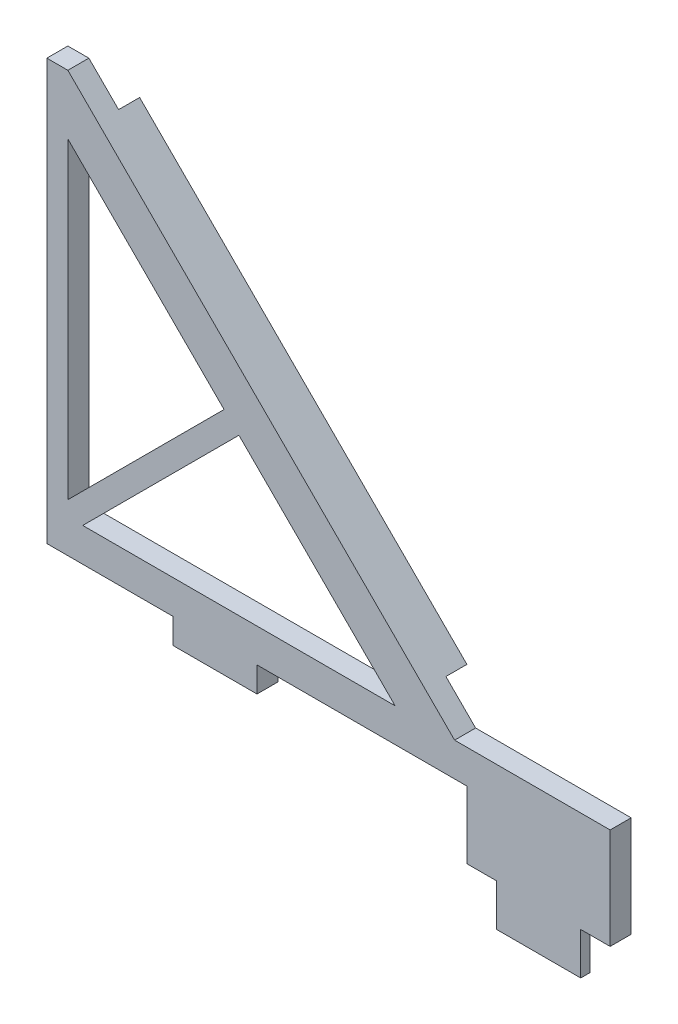
ISO-10303-21;
HEADER;
FILE_DESCRIPTION(('STEP AP214'),'2;1');
FILE_NAME('part.step','',(''),(''),'','','');
FILE_SCHEMA(('AUTOMOTIVE_DESIGN { 1 0 10303 214 1 1 1 1 }'));
ENDSEC;
DATA;
#1=APPLICATION_CONTEXT('core data for automotive mechanical design processes');
#2=APPLICATION_PROTOCOL_DEFINITION('international standard','automotive_design',2000,#1);
#3=PRODUCT_CONTEXT('',#1,'mechanical');
#4=PRODUCT('Part','Part','',(#3));
#5=PRODUCT_RELATED_PRODUCT_CATEGORY('part','',(#4));
#6=PRODUCT_DEFINITION_FORMATION('','',#4);
#7=PRODUCT_DEFINITION_CONTEXT('part definition',#1,'design');
#8=PRODUCT_DEFINITION('design','',#6,#7);
#9=PRODUCT_DEFINITION_SHAPE('','',#8);
#10=(LENGTH_UNIT() NAMED_UNIT(*) SI_UNIT(.MILLI.,.METRE.));
#11=(NAMED_UNIT(*) PLANE_ANGLE_UNIT() SI_UNIT($,.RADIAN.));
#12=(NAMED_UNIT(*) SI_UNIT($,.STERADIAN.) SOLID_ANGLE_UNIT());
#13=UNCERTAINTY_MEASURE_WITH_UNIT(LENGTH_MEASURE(1.E-05),#10,'distance_accuracy_value','');
#14=(GEOMETRIC_REPRESENTATION_CONTEXT(3) GLOBAL_UNCERTAINTY_ASSIGNED_CONTEXT((#13)) GLOBAL_UNIT_ASSIGNED_CONTEXT((#10,
#11,#12)) REPRESENTATION_CONTEXT('',''));
#15=CARTESIAN_POINT('',(0.,0.,0.));
#16=DIRECTION('',(0.,0.,1.));
#17=DIRECTION('',(1.,0.,0.));
#18=AXIS2_PLACEMENT_3D('',#15,#16,#17);
#19=CARTESIAN_POINT('',(0.,0.,0.));
#20=DIRECTION('',(0.,0.,1.));
#21=DIRECTION('',(1.,0.,0.));
#22=AXIS2_PLACEMENT_3D('',#19,#20,#21);
#23=PLANE('',#22);
#24=DIRECTION('',(-0.707106781186548,-0.707106781186547,0.));
#25=VECTOR('',#24,1.);
#26=CARTESIAN_POINT('',(-13.4893036162502,23.4309525048191,0.));
#27=LINE('',#26,#25);
#28=CARTESIAN_POINT('',(-13.4893036162502,23.4309525048191,0.));
#29=VERTEX_POINT('',#28);
#30=CARTESIAN_POINT('',(-15.3302561210692,21.59,0.));
#31=VERTEX_POINT('',#30);
#32=EDGE_CURVE('E57',#29,#31,#27,.T.);
#33=ORIENTED_EDGE('',*,*,#32,.F.);
#34=DIRECTION('',(0.707106781186548,-0.707106781186548,0.));
#35=VECTOR('',#34,1.);
#36=CARTESIAN_POINT('',(-62.9290474951807,72.8706963837496,0.));
#37=LINE('',#36,#35);
#38=CARTESIAN_POINT('',(-62.9290474951807,72.8706963837496,0.));
#39=VERTEX_POINT('',#38);
#40=EDGE_CURVE('E260',#39,#29,#37,.T.);
#41=ORIENTED_EDGE('',*,*,#40,.F.);
#42=DIRECTION('',(0.707106781186548,0.707106781186548,0.));
#43=VECTOR('',#42,1.);
#44=CARTESIAN_POINT('',(-64.77,71.0297438789303,0.));
#45=LINE('',#44,#43);
#46=CARTESIAN_POINT('',(-64.77,71.0297438789303,0.));
#47=VERTEX_POINT('',#46);
#48=EDGE_CURVE('E250',#47,#39,#45,.T.);
#49=ORIENTED_EDGE('',*,*,#48,.F.);
#50=DIRECTION('',(0.,-1.,0.));
#51=VECTOR('',#50,1.);
#52=CARTESIAN_POINT('',(-64.77,71.0297438789303,0.));
#53=LINE('',#52,#51);
#54=CARTESIAN_POINT('',(-64.77,23.8350640302668,0.));
#55=VERTEX_POINT('',#54);
#56=EDGE_CURVE('E309',#47,#55,#53,.T.);
#57=ORIENTED_EDGE('',*,*,#56,.T.);
#58=DIRECTION('',(0.707106781186544,0.707106781186551,0.));
#59=VECTOR('',#58,1.);
#60=CARTESIAN_POINT('',(-41.1726600756682,47.4324039545988,0.));
#61=LINE('',#60,#59);
#62=CARTESIAN_POINT('',(-41.1726600756682,47.4324039545988,0.));
#63=VERTEX_POINT('',#62);
#64=EDGE_CURVE('E313',#55,#63,#61,.T.);
#65=ORIENTED_EDGE('',*,*,#64,.T.);
#66=DIRECTION('',(-0.707106781186551,0.707106781186544,0.));
#67=VECTOR('',#66,1.);
#68=CARTESIAN_POINT('',(-15.3302561210692,21.59,0.));
#69=LINE('',#68,#67);
#70=CARTESIAN_POINT('',(-38.9275960454009,45.1873399243315,0.));
#71=VERTEX_POINT('',#70);
#72=EDGE_CURVE('E11',#71,#63,#69,.T.);
#73=ORIENTED_EDGE('',*,*,#72,.F.);
#74=DIRECTION('',(-0.707106781186544,-0.707106781186551,0.));
#75=VECTOR('',#74,1.);
#76=CARTESIAN_POINT('',(-38.9275960454009,45.1873399243315,0.));
#77=LINE('',#76,#75);
#78=CARTESIAN_POINT('',(-62.5249359697322,21.59,0.));
#79=VERTEX_POINT('',#78);
#80=EDGE_CURVE('E290',#71,#79,#77,.T.);
#81=ORIENTED_EDGE('',*,*,#80,.T.);
#82=DIRECTION('',(1.,0.,0.));
#83=VECTOR('',#82,1.);
#84=CARTESIAN_POINT('',(-62.5249359697322,21.59,0.));
#85=LINE('',#84,#83);
#86=EDGE_CURVE('E294',#79,#31,#85,.T.);
#87=ORIENTED_EDGE('',*,*,#86,.T.);
#88=EDGE_LOOP('',(#33,#41,#49,#57,#65,#73,#81,#87));
#89=FACE_BOUND('',#88,.T.);
#90=DIRECTION('',(-0.707106781186548,-0.707106781186548,0.));
#91=VECTOR('',#90,1.);
#92=CARTESIAN_POINT('',(-10.8401280605346,26.0801280605346,0.));
#93=LINE('',#92,#91);
#94=CARTESIAN_POINT('',(-10.8401280605346,26.0801280605346,0.));
#95=VERTEX_POINT('',#94);
#96=CARTESIAN_POINT('',(-12.6810805653539,24.2391755557153,0.));
#97=VERTEX_POINT('',#96);
#98=EDGE_CURVE('E796',#95,#97,#93,.T.);
#99=ORIENTED_EDGE('',*,*,#98,.F.);
#100=DIRECTION('',(-0.707106781186551,0.707106781186544,0.));
#101=VECTOR('',#100,1.);
#102=CARTESIAN_POINT('',(-6.35,21.59,0.));
#103=LINE('',#102,#101);
#104=CARTESIAN_POINT('',(-6.35,21.59,0.));
#105=VERTEX_POINT('',#104);
#106=EDGE_CURVE('E248',#105,#95,#103,.T.);
#107=ORIENTED_EDGE('',*,*,#106,.F.);
#108=DIRECTION('',(-1.,0.,0.));
#109=VECTOR('',#108,1.);
#110=CARTESIAN_POINT('',(17.145,21.59,0.));
#111=LINE('',#110,#109);
#112=CARTESIAN_POINT('',(17.145,21.59,0.));
#113=VERTEX_POINT('',#112);
#114=EDGE_CURVE('E365',#113,#105,#111,.T.);
#115=ORIENTED_EDGE('',*,*,#114,.F.);
#116=DIRECTION('',(0.,1.,0.));
#117=VECTOR('',#116,1.);
#118=CARTESIAN_POINT('',(17.145,6.35,0.));
#119=LINE('',#118,#117);
#120=CARTESIAN_POINT('',(17.145,6.35,0.));
#121=VERTEX_POINT('',#120);
#122=EDGE_CURVE('E328',#121,#113,#119,.T.);
#123=ORIENTED_EDGE('',*,*,#122,.F.);
#124=DIRECTION('',(1.,0.,0.));
#125=VECTOR('',#124,1.);
#126=CARTESIAN_POINT('',(0.,6.35,0.));
#127=LINE('',#126,#125);
#128=CARTESIAN_POINT('',(-4.445,6.35,0.));
#129=VERTEX_POINT('',#128);
#130=EDGE_CURVE('E333',#129,#121,#127,.T.);
#131=ORIENTED_EDGE('',*,*,#130,.F.);
#132=DIRECTION('',(0.,-1.,0.));
#133=VECTOR('',#132,1.);
#134=CARTESIAN_POINT('',(-4.445,6.35,0.));
#135=LINE('',#134,#133);
#136=CARTESIAN_POINT('',(-4.445,16.51,0.));
#137=VERTEX_POINT('',#136);
#138=EDGE_CURVE('E383',#137,#129,#135,.T.);
#139=ORIENTED_EDGE('',*,*,#138,.F.);
#140=DIRECTION('',(1.,0.,0.));
#141=VECTOR('',#140,1.);
#142=CARTESIAN_POINT('',(-36.195,16.51,0.));
#143=LINE('',#142,#141);
#144=CARTESIAN_POINT('',(-36.195,16.51,0.));
#145=VERTEX_POINT('',#144);
#146=EDGE_CURVE('E381',#145,#137,#143,.T.);
#147=ORIENTED_EDGE('',*,*,#146,.F.);
#148=DIRECTION('',(0.,1.,0.));
#149=VECTOR('',#148,1.);
#150=CARTESIAN_POINT('',(-36.195,12.7,0.));
#151=LINE('',#150,#149);
#152=CARTESIAN_POINT('',(-36.195,12.7,0.));
#153=VERTEX_POINT('',#152);
#154=EDGE_CURVE('E379',#153,#145,#151,.T.);
#155=ORIENTED_EDGE('',*,*,#154,.F.);
#156=DIRECTION('',(1.,0.,0.));
#157=VECTOR('',#156,1.);
#158=CARTESIAN_POINT('',(-48.895,12.7,0.));
#159=LINE('',#158,#157);
#160=CARTESIAN_POINT('',(-48.895,12.7,0.));
#161=VERTEX_POINT('',#160);
#162=EDGE_CURVE('E377',#161,#153,#159,.T.);
#163=ORIENTED_EDGE('',*,*,#162,.F.);
#164=DIRECTION('',(0.,-1.,0.));
#165=VECTOR('',#164,1.);
#166=CARTESIAN_POINT('',(-48.895,16.51,0.));
#167=LINE('',#166,#165);
#168=CARTESIAN_POINT('',(-48.895,16.51,0.));
#169=VERTEX_POINT('',#168);
#170=EDGE_CURVE('E375',#169,#161,#167,.T.);
#171=ORIENTED_EDGE('',*,*,#170,.F.);
#172=DIRECTION('',(1.,0.,0.));
#173=VECTOR('',#172,1.);
#174=CARTESIAN_POINT('',(-67.945,16.51,0.));
#175=LINE('',#174,#173);
#176=CARTESIAN_POINT('',(-67.945,16.51,0.));
#177=VERTEX_POINT('',#176);
#178=EDGE_CURVE('E373',#177,#169,#175,.T.);
#179=ORIENTED_EDGE('',*,*,#178,.F.);
#180=DIRECTION('',(0.,-1.,0.));
#181=VECTOR('',#180,1.);
#182=CARTESIAN_POINT('',(-67.945,80.0099999999994,0.));
#183=LINE('',#182,#181);
#184=CARTESIAN_POINT('',(-67.945,80.0099999999994,0.));
#185=VERTEX_POINT('',#184);
#186=EDGE_CURVE('E371',#185,#177,#183,.T.);
#187=ORIENTED_EDGE('',*,*,#186,.F.);
#188=DIRECTION('',(-1.,0.,0.));
#189=VECTOR('',#188,1.);
#190=CARTESIAN_POINT('',(-64.77,80.0099999999994,0.));
#191=LINE('',#190,#189);
#192=CARTESIAN_POINT('',(-64.77,80.0099999999994,0.));
#193=VERTEX_POINT('',#192);
#194=EDGE_CURVE('E369',#193,#185,#191,.T.);
#195=ORIENTED_EDGE('',*,*,#194,.F.);
#196=CARTESIAN_POINT('',(-60.2798719394657,75.5198719394651,0.));
#197=VERTEX_POINT('',#196);
#198=EDGE_CURVE('E367',#197,#193,#103,.T.);
#199=ORIENTED_EDGE('',*,*,#198,.F.);
#200=DIRECTION('',(0.707106781186549,0.707106781186546,0.));
#201=VECTOR('',#200,1.);
#202=CARTESIAN_POINT('',(-62.1208244442845,73.6789194346458,0.));
#203=LINE('',#202,#201);
#204=CARTESIAN_POINT('',(-62.1208244442845,73.6789194346458,0.));
#205=VERTEX_POINT('',#204);
#206=EDGE_CURVE('E242',#205,#197,#203,.T.);
#207=ORIENTED_EDGE('',*,*,#206,.F.);
#208=DIRECTION('',(-0.707106781186548,0.707106781186548,0.));
#209=VECTOR('',#208,1.);
#210=CARTESIAN_POINT('',(-12.6810805653539,24.2391755557153,0.));
#211=LINE('',#210,#209);
#212=EDGE_CURVE('E794',#97,#205,#211,.T.);
#213=ORIENTED_EDGE('',*,*,#212,.F.);
#214=EDGE_LOOP('',(#99,#107,#115,#123,#131,#139,#147,#155,#163,#171,#179,#187,#195,#199,#207,#213));
#215=FACE_BOUND('',#214,.T.);
#216=ADVANCED_FACE('F33',(#89,#215),#23,.F.);
#217=CARTESIAN_POINT('',(0.,0.,3.175));
#218=DIRECTION('',(0.,0.,1.));
#219=DIRECTION('',(1.,0.,0.));
#220=AXIS2_PLACEMENT_3D('',#217,#218,#219);
#221=PLANE('',#220);
#222=DIRECTION('',(0.,-1.,0.));
#223=VECTOR('',#222,1.);
#224=CARTESIAN_POINT('',(0.,0.,3.175));
#225=LINE('',#224,#223);
#226=CARTESIAN_POINT('',(0.,6.35,3.175));
#227=VERTEX_POINT('',#226);
#228=CARTESIAN_POINT('',(0.,0.,3.175));
#229=VERTEX_POINT('',#228);
#230=EDGE_CURVE('E329',#227,#229,#225,.T.);
#231=ORIENTED_EDGE('',*,*,#230,.T.);
#232=DIRECTION('',(1.,0.,0.));
#233=VECTOR('',#232,1.);
#234=CARTESIAN_POINT('',(0.,0.,3.175));
#235=LINE('',#234,#233);
#236=CARTESIAN_POINT('',(12.7,0.,3.175));
#237=VERTEX_POINT('',#236);
#238=EDGE_CURVE('E332',#229,#237,#235,.T.);
#239=ORIENTED_EDGE('',*,*,#238,.T.);
#240=DIRECTION('',(0.,1.,0.));
#241=VECTOR('',#240,1.);
#242=CARTESIAN_POINT('',(12.7,0.,3.175));
#243=LINE('',#242,#241);
#244=CARTESIAN_POINT('',(12.7,6.35,3.175));
#245=VERTEX_POINT('',#244);
#246=EDGE_CURVE('E335',#237,#245,#243,.T.);
#247=ORIENTED_EDGE('',*,*,#246,.T.);
#248=DIRECTION('',(1.,0.,0.));
#249=VECTOR('',#248,1.);
#250=CARTESIAN_POINT('',(12.7,6.35,3.175));
#251=LINE('',#250,#249);
#252=CARTESIAN_POINT('',(17.145,6.35,3.175));
#253=VERTEX_POINT('',#252);
#254=EDGE_CURVE('E337',#245,#253,#251,.T.);
#255=ORIENTED_EDGE('',*,*,#254,.T.);
#256=DIRECTION('',(0.,1.,0.));
#257=VECTOR('',#256,1.);
#258=CARTESIAN_POINT('',(17.145,6.35,3.175));
#259=LINE('',#258,#257);
#260=CARTESIAN_POINT('',(17.145,21.59,3.175));
#261=VERTEX_POINT('',#260);
#262=EDGE_CURVE('E339',#253,#261,#259,.T.);
#263=ORIENTED_EDGE('',*,*,#262,.T.);
#264=DIRECTION('',(-1.,0.,0.));
#265=VECTOR('',#264,1.);
#266=CARTESIAN_POINT('',(17.145,21.59,3.175));
#267=LINE('',#266,#265);
#268=CARTESIAN_POINT('',(-6.35,21.59,3.175));
#269=VERTEX_POINT('',#268);
#270=EDGE_CURVE('E341',#261,#269,#267,.T.);
#271=ORIENTED_EDGE('',*,*,#270,.T.);
#272=DIRECTION('',(-0.707106781186551,0.707106781186544,0.));
#273=VECTOR('',#272,1.);
#274=CARTESIAN_POINT('',(-6.35,21.59,3.175));
#275=LINE('',#274,#273);
#276=CARTESIAN_POINT('',(-64.77,80.0099999999994,3.175));
#277=VERTEX_POINT('',#276);
#278=EDGE_CURVE('E343',#269,#277,#275,.T.);
#279=ORIENTED_EDGE('',*,*,#278,.T.);
#280=DIRECTION('',(-1.,0.,0.));
#281=VECTOR('',#280,1.);
#282=CARTESIAN_POINT('',(-64.77,80.0099999999994,3.175));
#283=LINE('',#282,#281);
#284=CARTESIAN_POINT('',(-67.945,80.0099999999994,3.175));
#285=VERTEX_POINT('',#284);
#286=EDGE_CURVE('E345',#277,#285,#283,.T.);
#287=ORIENTED_EDGE('',*,*,#286,.T.);
#288=DIRECTION('',(0.,-1.,0.));
#289=VECTOR('',#288,1.);
#290=CARTESIAN_POINT('',(-67.945,80.0099999999994,3.175));
#291=LINE('',#290,#289);
#292=CARTESIAN_POINT('',(-67.945,16.51,3.175));
#293=VERTEX_POINT('',#292);
#294=EDGE_CURVE('E347',#285,#293,#291,.T.);
#295=ORIENTED_EDGE('',*,*,#294,.T.);
#296=DIRECTION('',(1.,0.,0.));
#297=VECTOR('',#296,1.);
#298=CARTESIAN_POINT('',(-67.945,16.51,3.175));
#299=LINE('',#298,#297);
#300=CARTESIAN_POINT('',(-48.895,16.51,3.175));
#301=VERTEX_POINT('',#300);
#302=EDGE_CURVE('E349',#293,#301,#299,.T.);
#303=ORIENTED_EDGE('',*,*,#302,.T.);
#304=DIRECTION('',(0.,-1.,0.));
#305=VECTOR('',#304,1.);
#306=CARTESIAN_POINT('',(-48.895,16.51,3.175));
#307=LINE('',#306,#305);
#308=CARTESIAN_POINT('',(-48.895,12.7,3.175));
#309=VERTEX_POINT('',#308);
#310=EDGE_CURVE('E351',#301,#309,#307,.T.);
#311=ORIENTED_EDGE('',*,*,#310,.T.);
#312=DIRECTION('',(1.,0.,0.));
#313=VECTOR('',#312,1.);
#314=CARTESIAN_POINT('',(-48.895,12.7,3.175));
#315=LINE('',#314,#313);
#316=CARTESIAN_POINT('',(-36.195,12.7,3.175));
#317=VERTEX_POINT('',#316);
#318=EDGE_CURVE('E353',#309,#317,#315,.T.);
#319=ORIENTED_EDGE('',*,*,#318,.T.);
#320=DIRECTION('',(0.,1.,0.));
#321=VECTOR('',#320,1.);
#322=CARTESIAN_POINT('',(-36.195,12.7,3.175));
#323=LINE('',#322,#321);
#324=CARTESIAN_POINT('',(-36.195,16.51,3.175));
#325=VERTEX_POINT('',#324);
#326=EDGE_CURVE('E355',#317,#325,#323,.T.);
#327=ORIENTED_EDGE('',*,*,#326,.T.);
#328=DIRECTION('',(1.,0.,0.));
#329=VECTOR('',#328,1.);
#330=CARTESIAN_POINT('',(-36.195,16.51,3.175));
#331=LINE('',#330,#329);
#332=CARTESIAN_POINT('',(-4.445,16.51,3.175));
#333=VERTEX_POINT('',#332);
#334=EDGE_CURVE('E357',#325,#333,#331,.T.);
#335=ORIENTED_EDGE('',*,*,#334,.T.);
#336=DIRECTION('',(0.,-1.,0.));
#337=VECTOR('',#336,1.);
#338=CARTESIAN_POINT('',(-4.445,6.35,3.175));
#339=LINE('',#338,#337);
#340=CARTESIAN_POINT('',(-4.445,6.35,3.175));
#341=VERTEX_POINT('',#340);
#342=EDGE_CURVE('E359',#333,#341,#339,.T.);
#343=ORIENTED_EDGE('',*,*,#342,.T.);
#344=DIRECTION('',(1.,0.,0.));
#345=VECTOR('',#344,1.);
#346=CARTESIAN_POINT('',(0.,6.35,3.175));
#347=LINE('',#346,#345);
#348=EDGE_CURVE('E361',#341,#227,#347,.T.);
#349=ORIENTED_EDGE('',*,*,#348,.T.);
#350=EDGE_LOOP('',(#231,#239,#247,#255,#263,#271,#279,#287,#295,#303,#311,#319,#327,#335,#343,#349));
#351=FACE_BOUND('',#350,.T.);
#352=DIRECTION('',(0.,-1.,0.));
#353=VECTOR('',#352,1.);
#354=CARTESIAN_POINT('',(-64.77,71.0297438789303,3.175));
#355=LINE('',#354,#353);
#356=CARTESIAN_POINT('',(-64.77,71.0297438789303,3.175));
#357=VERTEX_POINT('',#356);
#358=CARTESIAN_POINT('',(-64.77,23.8350640302668,3.175));
#359=VERTEX_POINT('',#358);
#360=EDGE_CURVE('E312',#357,#359,#355,.T.);
#361=ORIENTED_EDGE('',*,*,#360,.F.);
#362=DIRECTION('',(-0.707106781186551,0.707106781186544,0.));
#363=VECTOR('',#362,1.);
#364=CARTESIAN_POINT('',(-41.1726600756682,47.4324039545988,3.175));
#365=LINE('',#364,#363);
#366=CARTESIAN_POINT('',(-41.1726600756682,47.4324039545988,3.175));
#367=VERTEX_POINT('',#366);
#368=EDGE_CURVE('E310',#367,#357,#365,.T.);
#369=ORIENTED_EDGE('',*,*,#368,.F.);
#370=DIRECTION('',(0.707106781186544,0.707106781186551,0.));
#371=VECTOR('',#370,1.);
#372=CARTESIAN_POINT('',(-41.1726600756682,47.4324039545988,3.175));
#373=LINE('',#372,#371);
#374=EDGE_CURVE('E316',#359,#367,#373,.T.);
#375=ORIENTED_EDGE('',*,*,#374,.F.);
#376=EDGE_LOOP('',(#361,#369,#375));
#377=FACE_BOUND('',#376,.T.);
#378=DIRECTION('',(-0.707106781186544,-0.707106781186551,0.));
#379=VECTOR('',#378,1.);
#380=CARTESIAN_POINT('',(-38.9275960454009,45.1873399243315,3.175));
#381=LINE('',#380,#379);
#382=CARTESIAN_POINT('',(-38.9275960454009,45.1873399243315,3.175));
#383=VERTEX_POINT('',#382);
#384=CARTESIAN_POINT('',(-62.5249359697322,21.59,3.175));
#385=VERTEX_POINT('',#384);
#386=EDGE_CURVE('E293',#383,#385,#381,.T.);
#387=ORIENTED_EDGE('',*,*,#386,.F.);
#388=DIRECTION('',(-0.707106781186551,0.707106781186544,0.));
#389=VECTOR('',#388,1.);
#390=CARTESIAN_POINT('',(-15.3302561210692,21.59,3.175));
#391=LINE('',#390,#389);
#392=CARTESIAN_POINT('',(-15.3302561210692,21.59,3.175));
#393=VERTEX_POINT('',#392);
#394=EDGE_CURVE('E291',#393,#383,#391,.T.);
#395=ORIENTED_EDGE('',*,*,#394,.F.);
#396=DIRECTION('',(1.,0.,0.));
#397=VECTOR('',#396,1.);
#398=CARTESIAN_POINT('',(-62.5249359697322,21.59,3.175));
#399=LINE('',#398,#397);
#400=EDGE_CURVE('E297',#385,#393,#399,.T.);
#401=ORIENTED_EDGE('',*,*,#400,.F.);
#402=EDGE_LOOP('',(#387,#395,#401));
#403=FACE_BOUND('',#402,.T.);
#404=ADVANCED_FACE('F450',(#351,#377,#403),#221,.T.);
#405=CARTESIAN_POINT('',(0.,0.,3.175));
#406=DIRECTION('',(1.,0.,0.));
#407=DIRECTION('',(0.,0.,-1.));
#408=AXIS2_PLACEMENT_3D('',#405,#406,#407);
#409=PLANE('',#408);
#410=DIRECTION('',(0.,0.,-1.));
#411=VECTOR('',#410,1.);
#412=CARTESIAN_POINT('',(0.,6.35,3.175));
#413=LINE('',#412,#411);
#414=CARTESIAN_POINT('',(0.,6.35,1.778));
#415=VERTEX_POINT('',#414);
#416=EDGE_CURVE('E363',#227,#415,#413,.T.);
#417=ORIENTED_EDGE('',*,*,#416,.T.);
#418=DIRECTION('',(0.,1.,0.));
#419=VECTOR('',#418,1.);
#420=CARTESIAN_POINT('',(0.,0.,1.778));
#421=LINE('',#420,#419);
#422=CARTESIAN_POINT('',(0.,0.,1.778));
#423=VERTEX_POINT('',#422);
#424=EDGE_CURVE('E285',#423,#415,#421,.T.);
#425=ORIENTED_EDGE('',*,*,#424,.F.);
#426=DIRECTION('',(0.,0.,-1.));
#427=VECTOR('',#426,1.);
#428=CARTESIAN_POINT('',(0.,0.,3.175));
#429=LINE('',#428,#427);
#430=EDGE_CURVE('E37',#229,#423,#429,.T.);
#431=ORIENTED_EDGE('',*,*,#430,.F.);
#432=ORIENTED_EDGE('',*,*,#230,.F.);
#433=EDGE_LOOP('',(#417,#425,#431,#432));
#434=FACE_BOUND('',#433,.T.);
#435=ADVANCED_FACE('F35',(#434),#409,.F.);
#436=CARTESIAN_POINT('',(0.,0.,3.175));
#437=DIRECTION('',(0.,1.,0.));
#438=DIRECTION('',(0.,0.,1.));
#439=AXIS2_PLACEMENT_3D('',#436,#437,#438);
#440=PLANE('',#439);
#441=ORIENTED_EDGE('',*,*,#430,.T.);
#442=DIRECTION('',(-1.,0.,0.));
#443=VECTOR('',#442,1.);
#444=CARTESIAN_POINT('',(12.7,0.,1.778));
#445=LINE('',#444,#443);
#446=CARTESIAN_POINT('',(12.7,0.,1.778));
#447=VERTEX_POINT('',#446);
#448=EDGE_CURVE('E283',#447,#423,#445,.T.);
#449=ORIENTED_EDGE('',*,*,#448,.F.);
#450=DIRECTION('',(0.,0.,-1.));
#451=VECTOR('',#450,1.);
#452=CARTESIAN_POINT('',(12.7,0.,3.175));
#453=LINE('',#452,#451);
#454=EDGE_CURVE('E425',#237,#447,#453,.T.);
#455=ORIENTED_EDGE('',*,*,#454,.F.);
#456=ORIENTED_EDGE('',*,*,#238,.F.);
#457=EDGE_LOOP('',(#441,#449,#455,#456));
#458=FACE_BOUND('',#457,.T.);
#459=ADVANCED_FACE('F435',(#458),#440,.F.);
#460=CARTESIAN_POINT('',(12.7,0.,3.175));
#461=DIRECTION('',(-1.,0.,0.));
#462=DIRECTION('',(0.,0.,1.));
#463=AXIS2_PLACEMENT_3D('',#460,#461,#462);
#464=PLANE('',#463);
#465=ORIENTED_EDGE('',*,*,#454,.T.);
#466=DIRECTION('',(0.,-1.,0.));
#467=VECTOR('',#466,1.);
#468=CARTESIAN_POINT('',(12.7,0.,1.778));
#469=LINE('',#468,#467);
#470=CARTESIAN_POINT('',(12.7,6.35,1.778));
#471=VERTEX_POINT('',#470);
#472=EDGE_CURVE('E281',#471,#447,#469,.T.);
#473=ORIENTED_EDGE('',*,*,#472,.F.);
#474=DIRECTION('',(0.,0.,-1.));
#475=VECTOR('',#474,1.);
#476=CARTESIAN_POINT('',(12.7,6.35,3.175));
#477=LINE('',#476,#475);
#478=EDGE_CURVE('E423',#245,#471,#477,.T.);
#479=ORIENTED_EDGE('',*,*,#478,.F.);
#480=ORIENTED_EDGE('',*,*,#246,.F.);
#481=EDGE_LOOP('',(#465,#473,#479,#480));
#482=FACE_BOUND('',#481,.T.);
#483=ADVANCED_FACE('F443',(#482),#464,.F.);
#484=CARTESIAN_POINT('',(17.145,6.35,3.175));
#485=DIRECTION('',(-1.,0.,0.));
#486=DIRECTION('',(0.,-1.,0.));
#487=AXIS2_PLACEMENT_3D('',#484,#485,#486);
#488=PLANE('',#487);
#489=ORIENTED_EDGE('',*,*,#122,.T.);
#490=DIRECTION('',(0.,0.,-1.));
#491=VECTOR('',#490,1.);
#492=CARTESIAN_POINT('',(17.145,21.59,3.175));
#493=LINE('',#492,#491);
#494=EDGE_CURVE('E417',#261,#113,#493,.T.);
#495=ORIENTED_EDGE('',*,*,#494,.F.);
#496=ORIENTED_EDGE('',*,*,#262,.F.);
#497=DIRECTION('',(0.,0.,-1.));
#498=VECTOR('',#497,1.);
#499=CARTESIAN_POINT('',(17.145,6.35,3.175));
#500=LINE('',#499,#498);
#501=EDGE_CURVE('E420',#253,#121,#500,.T.);
#502=ORIENTED_EDGE('',*,*,#501,.T.);
#503=EDGE_LOOP('',(#489,#495,#496,#502));
#504=FACE_BOUND('',#503,.T.);
#505=ADVANCED_FACE('F464',(#504),#488,.F.);
#506=CARTESIAN_POINT('',(17.145,21.59,3.175));
#507=DIRECTION('',(0.,-1.,0.));
#508=DIRECTION('',(1.,0.,0.));
#509=AXIS2_PLACEMENT_3D('',#506,#507,#508);
#510=PLANE('',#509);
#511=ORIENTED_EDGE('',*,*,#114,.T.);
#512=DIRECTION('',(0.,0.,-1.));
#513=VECTOR('',#512,1.);
#514=CARTESIAN_POINT('',(-6.35,21.59,3.175));
#515=LINE('',#514,#513);
#516=EDGE_CURVE('E415',#269,#105,#515,.T.);
#517=ORIENTED_EDGE('',*,*,#516,.F.);
#518=ORIENTED_EDGE('',*,*,#270,.F.);
#519=ORIENTED_EDGE('',*,*,#494,.T.);
#520=EDGE_LOOP('',(#511,#517,#518,#519));
#521=FACE_BOUND('',#520,.T.);
#522=ADVANCED_FACE('F467',(#521),#510,.F.);
#523=CARTESIAN_POINT('',(-6.35,21.59,3.175));
#524=DIRECTION('',(-0.707106781186544,-0.707106781186551,0.));
#525=DIRECTION('',(0.707106781186551,-0.707106781186544,0.));
#526=AXIS2_PLACEMENT_3D('',#523,#524,#525);
#527=PLANE('',#526);
#528=ORIENTED_EDGE('',*,*,#106,.T.);
#529=DIRECTION('',(0.,0.,1.));
#530=VECTOR('',#529,1.);
#531=CARTESIAN_POINT('',(-10.8401280605346,26.0801280605346,-3.175));
#532=LINE('',#531,#530);
#533=CARTESIAN_POINT('',(-10.8401280605346,26.0801280605346,-3.175));
#534=VERTEX_POINT('',#533);
#535=EDGE_CURVE('E230',#534,#95,#532,.T.);
#536=ORIENTED_EDGE('',*,*,#535,.F.);
#537=DIRECTION('',(0.707106781186547,-0.707106781186548,0.));
#538=VECTOR('',#537,1.);
#539=CARTESIAN_POINT('',(-60.2798719394651,75.5198719394651,-3.175));
#540=LINE('',#539,#538);
#541=CARTESIAN_POINT('',(-60.2798719394651,75.5198719394651,-3.175));
#542=VERTEX_POINT('',#541);
#543=EDGE_CURVE('E237',#542,#534,#540,.T.);
#544=ORIENTED_EDGE('',*,*,#543,.F.);
#545=DIRECTION('',(0.,0.,1.));
#546=VECTOR('',#545,1.);
#547=CARTESIAN_POINT('',(-60.2798719394651,75.5198719394651,-3.175));
#548=LINE('',#547,#546);
#549=EDGE_CURVE('E49',#542,#197,#548,.T.);
#550=ORIENTED_EDGE('',*,*,#549,.T.);
#551=ORIENTED_EDGE('',*,*,#198,.T.);
#552=DIRECTION('',(0.,0.,-1.));
#553=VECTOR('',#552,1.);
#554=CARTESIAN_POINT('',(-64.77,80.0099999999994,3.175));
#555=LINE('',#554,#553);
#556=EDGE_CURVE('E412',#277,#193,#555,.T.);
#557=ORIENTED_EDGE('',*,*,#556,.F.);
#558=ORIENTED_EDGE('',*,*,#278,.F.);
#559=ORIENTED_EDGE('',*,*,#516,.T.);
#560=EDGE_LOOP('',(#528,#536,#544,#550,#551,#557,#558,#559));
#561=FACE_BOUND('',#560,.T.);
#562=ADVANCED_FACE('F245',(#561),#527,.F.);
#563=CARTESIAN_POINT('',(-64.77,80.0099999999994,3.175));
#564=DIRECTION('',(0.,-1.,0.));
#565=DIRECTION('',(0.,0.,-1.));
#566=AXIS2_PLACEMENT_3D('',#563,#564,#565);
#567=PLANE('',#566);
#568=ORIENTED_EDGE('',*,*,#194,.T.);
#569=DIRECTION('',(0.,0.,-1.));
#570=VECTOR('',#569,1.);
#571=CARTESIAN_POINT('',(-67.945,80.0099999999994,3.175));
#572=LINE('',#571,#570);
#573=EDGE_CURVE('E409',#285,#185,#572,.T.);
#574=ORIENTED_EDGE('',*,*,#573,.F.);
#575=ORIENTED_EDGE('',*,*,#286,.F.);
#576=ORIENTED_EDGE('',*,*,#556,.T.);
#577=EDGE_LOOP('',(#568,#574,#575,#576));
#578=FACE_BOUND('',#577,.T.);
#579=ADVANCED_FACE('F476',(#578),#567,.F.);
#580=CARTESIAN_POINT('',(-67.945,80.0099999999994,3.175));
#581=DIRECTION('',(1.,0.,0.));
#582=DIRECTION('',(0.,0.,-1.));
#583=AXIS2_PLACEMENT_3D('',#580,#581,#582);
#584=PLANE('',#583);
#585=ORIENTED_EDGE('',*,*,#186,.T.);
#586=DIRECTION('',(0.,0.,-1.));
#587=VECTOR('',#586,1.);
#588=CARTESIAN_POINT('',(-67.945,16.51,3.175));
#589=LINE('',#588,#587);
#590=EDGE_CURVE('E406',#293,#177,#589,.T.);
#591=ORIENTED_EDGE('',*,*,#590,.F.);
#592=ORIENTED_EDGE('',*,*,#294,.F.);
#593=ORIENTED_EDGE('',*,*,#573,.T.);
#594=EDGE_LOOP('',(#585,#591,#592,#593));
#595=FACE_BOUND('',#594,.T.);
#596=ADVANCED_FACE('F481',(#595),#584,.F.);
#597=CARTESIAN_POINT('',(-67.945,16.51,3.175));
#598=DIRECTION('',(0.,1.,0.));
#599=DIRECTION('',(0.,0.,1.));
#600=AXIS2_PLACEMENT_3D('',#597,#598,#599);
#601=PLANE('',#600);
#602=ORIENTED_EDGE('',*,*,#178,.T.);
#603=DIRECTION('',(0.,0.,-1.));
#604=VECTOR('',#603,1.);
#605=CARTESIAN_POINT('',(-48.895,16.51,3.175));
#606=LINE('',#605,#604);
#607=EDGE_CURVE('E403',#301,#169,#606,.T.);
#608=ORIENTED_EDGE('',*,*,#607,.F.);
#609=ORIENTED_EDGE('',*,*,#302,.F.);
#610=ORIENTED_EDGE('',*,*,#590,.T.);
#611=EDGE_LOOP('',(#602,#608,#609,#610));
#612=FACE_BOUND('',#611,.T.);
#613=ADVANCED_FACE('F487',(#612),#601,.F.);
#614=CARTESIAN_POINT('',(-48.895,16.51,3.175));
#615=DIRECTION('',(1.,0.,0.));
#616=DIRECTION('',(0.,0.,-1.));
#617=AXIS2_PLACEMENT_3D('',#614,#615,#616);
#618=PLANE('',#617);
#619=ORIENTED_EDGE('',*,*,#170,.T.);
#620=DIRECTION('',(0.,0.,-1.));
#621=VECTOR('',#620,1.);
#622=CARTESIAN_POINT('',(-48.895,12.7,3.175));
#623=LINE('',#622,#621);
#624=EDGE_CURVE('E400',#309,#161,#623,.T.);
#625=ORIENTED_EDGE('',*,*,#624,.F.);
#626=ORIENTED_EDGE('',*,*,#310,.F.);
#627=ORIENTED_EDGE('',*,*,#607,.T.);
#628=EDGE_LOOP('',(#619,#625,#626,#627));
#629=FACE_BOUND('',#628,.T.);
#630=ADVANCED_FACE('F491',(#629),#618,.F.);
#631=CARTESIAN_POINT('',(-48.895,12.7,3.175));
#632=DIRECTION('',(0.,1.,0.));
#633=DIRECTION('',(0.,0.,1.));
#634=AXIS2_PLACEMENT_3D('',#631,#632,#633);
#635=PLANE('',#634);
#636=ORIENTED_EDGE('',*,*,#162,.T.);
#637=DIRECTION('',(0.,0.,-1.));
#638=VECTOR('',#637,1.);
#639=CARTESIAN_POINT('',(-36.195,12.7,3.175));
#640=LINE('',#639,#638);
#641=EDGE_CURVE('E397',#317,#153,#640,.T.);
#642=ORIENTED_EDGE('',*,*,#641,.F.);
#643=ORIENTED_EDGE('',*,*,#318,.F.);
#644=ORIENTED_EDGE('',*,*,#624,.T.);
#645=EDGE_LOOP('',(#636,#642,#643,#644));
#646=FACE_BOUND('',#645,.T.);
#647=ADVANCED_FACE('F496',(#646),#635,.F.);
#648=CARTESIAN_POINT('',(-36.195,12.7,3.175));
#649=DIRECTION('',(-1.,0.,0.));
#650=DIRECTION('',(0.,0.,1.));
#651=AXIS2_PLACEMENT_3D('',#648,#649,#650);
#652=PLANE('',#651);
#653=ORIENTED_EDGE('',*,*,#154,.T.);
#654=DIRECTION('',(0.,0.,-1.));
#655=VECTOR('',#654,1.);
#656=CARTESIAN_POINT('',(-36.195,16.51,3.175));
#657=LINE('',#656,#655);
#658=EDGE_CURVE('E394',#325,#145,#657,.T.);
#659=ORIENTED_EDGE('',*,*,#658,.F.);
#660=ORIENTED_EDGE('',*,*,#326,.F.);
#661=ORIENTED_EDGE('',*,*,#641,.T.);
#662=EDGE_LOOP('',(#653,#659,#660,#661));
#663=FACE_BOUND('',#662,.T.);
#664=ADVANCED_FACE('F502',(#663),#652,.F.);
#665=CARTESIAN_POINT('',(-36.195,16.51,3.175));
#666=DIRECTION('',(0.,1.,0.));
#667=DIRECTION('',(0.,0.,1.));
#668=AXIS2_PLACEMENT_3D('',#665,#666,#667);
#669=PLANE('',#668);
#670=ORIENTED_EDGE('',*,*,#146,.T.);
#671=DIRECTION('',(0.,0.,-1.));
#672=VECTOR('',#671,1.);
#673=CARTESIAN_POINT('',(-4.445,16.51,3.175));
#674=LINE('',#673,#672);
#675=EDGE_CURVE('E391',#333,#137,#674,.T.);
#676=ORIENTED_EDGE('',*,*,#675,.F.);
#677=ORIENTED_EDGE('',*,*,#334,.F.);
#678=ORIENTED_EDGE('',*,*,#658,.T.);
#679=EDGE_LOOP('',(#670,#676,#677,#678));
#680=FACE_BOUND('',#679,.T.);
#681=ADVANCED_FACE('F505',(#680),#669,.F.);
#682=CARTESIAN_POINT('',(-4.445,6.35,3.175));
#683=DIRECTION('',(1.,0.,0.));
#684=DIRECTION('',(0.,1.,0.));
#685=AXIS2_PLACEMENT_3D('',#682,#683,#684);
#686=PLANE('',#685);
#687=ORIENTED_EDGE('',*,*,#138,.T.);
#688=DIRECTION('',(0.,0.,-1.));
#689=VECTOR('',#688,1.);
#690=CARTESIAN_POINT('',(-4.445,6.35,3.175));
#691=LINE('',#690,#689);
#692=EDGE_CURVE('E388',#341,#129,#691,.T.);
#693=ORIENTED_EDGE('',*,*,#692,.F.);
#694=ORIENTED_EDGE('',*,*,#342,.F.);
#695=ORIENTED_EDGE('',*,*,#675,.T.);
#696=EDGE_LOOP('',(#687,#693,#694,#695));
#697=FACE_BOUND('',#696,.T.);
#698=ADVANCED_FACE('F506',(#697),#686,.F.);
#699=CARTESIAN_POINT('',(0.,6.35,3.175));
#700=DIRECTION('',(0.,1.,0.));
#701=DIRECTION('',(0.,0.,1.));
#702=AXIS2_PLACEMENT_3D('',#699,#700,#701);
#703=PLANE('',#702);
#704=ORIENTED_EDGE('',*,*,#130,.T.);
#705=ORIENTED_EDGE('',*,*,#501,.F.);
#706=ORIENTED_EDGE('',*,*,#254,.F.);
#707=ORIENTED_EDGE('',*,*,#478,.T.);
#708=DIRECTION('',(1.,0.,0.));
#709=VECTOR('',#708,1.);
#710=CARTESIAN_POINT('',(12.7,6.35,1.778));
#711=LINE('',#710,#709);
#712=EDGE_CURVE('E288',#415,#471,#711,.T.);
#713=ORIENTED_EDGE('',*,*,#712,.F.);
#714=ORIENTED_EDGE('',*,*,#416,.F.);
#715=ORIENTED_EDGE('',*,*,#348,.F.);
#716=ORIENTED_EDGE('',*,*,#692,.T.);
#717=EDGE_LOOP('',(#704,#705,#706,#707,#713,#714,#715,#716));
#718=FACE_BOUND('',#717,.T.);
#719=ADVANCED_FACE('F446',(#718),#703,.F.);
#720=CARTESIAN_POINT('',(-41.1726600756682,47.4324039545988,3.175));
#721=DIRECTION('',(-0.707106781186544,-0.707106781186551,0.));
#722=DIRECTION('',(0.707106781186551,-0.707106781186544,0.));
#723=AXIS2_PLACEMENT_3D('',#720,#721,#722);
#724=PLANE('',#723);
#725=DIRECTION('',(0.,0.,-1.));
#726=VECTOR('',#725,1.);
#727=CARTESIAN_POINT('',(-64.77,71.0297438789303,3.175));
#728=LINE('',#727,#726);
#729=EDGE_CURVE('E326',#357,#47,#728,.T.);
#730=ORIENTED_EDGE('',*,*,#729,.T.);
#731=DIRECTION('',(0.,0.,1.));
#732=VECTOR('',#731,1.);
#733=CARTESIAN_POINT('',(-64.77,71.0297438789303,-3.175));
#734=LINE('',#733,#732);
#735=CARTESIAN_POINT('',(-64.77,71.0297438789303,-3.175));
#736=VERTEX_POINT('',#735);
#737=EDGE_CURVE('E275',#736,#47,#734,.T.);
#738=ORIENTED_EDGE('',*,*,#737,.F.);
#739=DIRECTION('',(-0.707106781186551,0.707106781186544,0.));
#740=VECTOR('',#739,1.);
#741=CARTESIAN_POINT('',(-15.3302561210692,21.59,-3.175));
#742=LINE('',#741,#740);
#743=CARTESIAN_POINT('',(-15.3302561210692,21.59,-3.175));
#744=VERTEX_POINT('',#743);
#745=EDGE_CURVE('E259',#744,#736,#742,.T.);
#746=ORIENTED_EDGE('',*,*,#745,.F.);
#747=DIRECTION('',(0.,0.,1.));
#748=VECTOR('',#747,1.);
#749=CARTESIAN_POINT('',(-15.3302561210692,21.59,-3.175));
#750=LINE('',#749,#748);
#751=EDGE_CURVE('E278',#744,#31,#750,.T.);
#752=ORIENTED_EDGE('',*,*,#751,.T.);
#753=DIRECTION('',(0.,0.,-1.));
#754=VECTOR('',#753,1.);
#755=CARTESIAN_POINT('',(-15.3302561210692,21.59,3.175));
#756=LINE('',#755,#754);
#757=EDGE_CURVE('E299',#393,#31,#756,.T.);
#758=ORIENTED_EDGE('',*,*,#757,.F.);
#759=ORIENTED_EDGE('',*,*,#394,.T.);
#760=DIRECTION('',(0.,0.,-1.));
#761=VECTOR('',#760,1.);
#762=CARTESIAN_POINT('',(-38.9275960454009,45.1873399243315,3.175));
#763=LINE('',#762,#761);
#764=EDGE_CURVE('E306',#383,#71,#763,.T.);
#765=ORIENTED_EDGE('',*,*,#764,.T.);
#766=ORIENTED_EDGE('',*,*,#72,.T.);
#767=DIRECTION('',(0.,0.,-1.));
#768=VECTOR('',#767,1.);
#769=CARTESIAN_POINT('',(-41.1726600756682,47.4324039545988,3.175));
#770=LINE('',#769,#768);
#771=EDGE_CURVE('E318',#367,#63,#770,.T.);
#772=ORIENTED_EDGE('',*,*,#771,.F.);
#773=ORIENTED_EDGE('',*,*,#368,.T.);
#774=EDGE_LOOP('',(#730,#738,#746,#752,#758,#759,#765,#766,#772,#773));
#775=FACE_BOUND('',#774,.T.);
#776=ADVANCED_FACE('F513',(#775),#724,.T.);
#777=CARTESIAN_POINT('',(-64.77,71.0297438789303,3.175));
#778=DIRECTION('',(1.,0.,0.));
#779=DIRECTION('',(0.,1.,0.));
#780=AXIS2_PLACEMENT_3D('',#777,#778,#779);
#781=PLANE('',#780);
#782=ORIENTED_EDGE('',*,*,#56,.F.);
#783=ORIENTED_EDGE('',*,*,#729,.F.);
#784=ORIENTED_EDGE('',*,*,#360,.T.);
#785=DIRECTION('',(0.,0.,-1.));
#786=VECTOR('',#785,1.);
#787=CARTESIAN_POINT('',(-64.77,23.8350640302668,3.175));
#788=LINE('',#787,#786);
#789=EDGE_CURVE('E324',#359,#55,#788,.T.);
#790=ORIENTED_EDGE('',*,*,#789,.T.);
#791=EDGE_LOOP('',(#782,#783,#784,#790));
#792=FACE_BOUND('',#791,.T.);
#793=ADVANCED_FACE('F525',(#792),#781,.T.);
#794=CARTESIAN_POINT('',(-41.1726600756682,47.4324039545988,3.175));
#795=DIRECTION('',(-0.707106781186551,0.707106781186544,0.));
#796=DIRECTION('',(-0.707106781186544,-0.707106781186551,0.));
#797=AXIS2_PLACEMENT_3D('',#794,#795,#796);
#798=PLANE('',#797);
#799=ORIENTED_EDGE('',*,*,#64,.F.);
#800=ORIENTED_EDGE('',*,*,#789,.F.);
#801=ORIENTED_EDGE('',*,*,#374,.T.);
#802=ORIENTED_EDGE('',*,*,#771,.T.);
#803=EDGE_LOOP('',(#799,#800,#801,#802));
#804=FACE_BOUND('',#803,.T.);
#805=ADVANCED_FACE('F529',(#804),#798,.T.);
#806=CARTESIAN_POINT('',(-38.9275960454009,45.1873399243315,3.175));
#807=DIRECTION('',(0.707106781186551,-0.707106781186544,0.));
#808=DIRECTION('',(0.707106781186544,0.707106781186551,0.));
#809=AXIS2_PLACEMENT_3D('',#806,#807,#808);
#810=PLANE('',#809);
#811=ORIENTED_EDGE('',*,*,#80,.F.);
#812=ORIENTED_EDGE('',*,*,#764,.F.);
#813=ORIENTED_EDGE('',*,*,#386,.T.);
#814=DIRECTION('',(0.,0.,-1.));
#815=VECTOR('',#814,1.);
#816=CARTESIAN_POINT('',(-62.5249359697322,21.59,3.175));
#817=LINE('',#816,#815);
#818=EDGE_CURVE('E304',#385,#79,#817,.T.);
#819=ORIENTED_EDGE('',*,*,#818,.T.);
#820=EDGE_LOOP('',(#811,#812,#813,#819));
#821=FACE_BOUND('',#820,.T.);
#822=ADVANCED_FACE('F533',(#821),#810,.T.);
#823=CARTESIAN_POINT('',(-62.5249359697322,21.59,3.175));
#824=DIRECTION('',(0.,1.,0.));
#825=DIRECTION('',(-1.,0.,0.));
#826=AXIS2_PLACEMENT_3D('',#823,#824,#825);
#827=PLANE('',#826);
#828=ORIENTED_EDGE('',*,*,#86,.F.);
#829=ORIENTED_EDGE('',*,*,#818,.F.);
#830=ORIENTED_EDGE('',*,*,#400,.T.);
#831=ORIENTED_EDGE('',*,*,#757,.T.);
#832=EDGE_LOOP('',(#828,#829,#830,#831));
#833=FACE_BOUND('',#832,.T.);
#834=ADVANCED_FACE('F537',(#833),#827,.T.);
#835=CARTESIAN_POINT('',(0.,0.,1.778));
#836=DIRECTION('',(0.,0.,1.));
#837=DIRECTION('',(1.,0.,0.));
#838=AXIS2_PLACEMENT_3D('',#835,#836,#837);
#839=PLANE('',#838);
#840=ORIENTED_EDGE('',*,*,#472,.T.);
#841=ORIENTED_EDGE('',*,*,#448,.T.);
#842=ORIENTED_EDGE('',*,*,#424,.T.);
#843=ORIENTED_EDGE('',*,*,#712,.T.);
#844=EDGE_LOOP('',(#840,#841,#842,#843));
#845=FACE_BOUND('',#844,.T.);
#846=ADVANCED_FACE('F441',(#845),#839,.F.);
#847=CARTESIAN_POINT('',(-13.4893036162502,23.4309525048191,-3.175));
#848=DIRECTION('',(-0.707106781186547,0.707106781186548,0.));
#849=DIRECTION('',(-0.707106781186548,-0.707106781186547,0.));
#850=AXIS2_PLACEMENT_3D('',#847,#848,#849);
#851=PLANE('',#850);
#852=ORIENTED_EDGE('',*,*,#32,.T.);
#853=ORIENTED_EDGE('',*,*,#751,.F.);
#854=DIRECTION('',(-0.707106781186548,-0.707106781186547,0.));
#855=VECTOR('',#854,1.);
#856=CARTESIAN_POINT('',(-13.4893036162502,23.4309525048191,-3.175));
#857=LINE('',#856,#855);
#858=CARTESIAN_POINT('',(-13.4893036162502,23.4309525048191,-3.175));
#859=VERTEX_POINT('',#858);
#860=EDGE_CURVE('E256',#859,#744,#857,.T.);
#861=ORIENTED_EDGE('',*,*,#860,.F.);
#862=DIRECTION('',(0.,0.,1.));
#863=VECTOR('',#862,1.);
#864=CARTESIAN_POINT('',(-13.4893036162502,23.4309525048191,-3.175));
#865=LINE('',#864,#863);
#866=EDGE_CURVE('E265',#859,#29,#865,.T.);
#867=ORIENTED_EDGE('',*,*,#866,.T.);
#868=EDGE_LOOP('',(#852,#853,#861,#867));
#869=FACE_BOUND('',#868,.T.);
#870=ADVANCED_FACE('F544',(#869),#851,.F.);
#871=CARTESIAN_POINT('',(-64.77,71.0297438789303,-3.175));
#872=DIRECTION('',(0.707106781186548,-0.707106781186548,0.));
#873=DIRECTION('',(0.707106781186548,0.707106781186548,0.));
#874=AXIS2_PLACEMENT_3D('',#871,#872,#873);
#875=PLANE('',#874);
#876=ORIENTED_EDGE('',*,*,#48,.T.);
#877=DIRECTION('',(0.,0.,1.));
#878=VECTOR('',#877,1.);
#879=CARTESIAN_POINT('',(-62.9290474951807,72.8706963837496,-3.175));
#880=LINE('',#879,#878);
#881=CARTESIAN_POINT('',(-62.9290474951807,72.8706963837496,-3.175));
#882=VERTEX_POINT('',#881);
#883=EDGE_CURVE('E272',#882,#39,#880,.T.);
#884=ORIENTED_EDGE('',*,*,#883,.F.);
#885=DIRECTION('',(0.707106781186548,0.707106781186548,0.));
#886=VECTOR('',#885,1.);
#887=CARTESIAN_POINT('',(-64.77,71.0297438789303,-3.175));
#888=LINE('',#887,#886);
#889=EDGE_CURVE('E262',#736,#882,#888,.T.);
#890=ORIENTED_EDGE('',*,*,#889,.F.);
#891=ORIENTED_EDGE('',*,*,#737,.T.);
#892=EDGE_LOOP('',(#876,#884,#890,#891));
#893=FACE_BOUND('',#892,.T.);
#894=ADVANCED_FACE('F547',(#893),#875,.F.);
#895=CARTESIAN_POINT('',(-62.9290474951807,72.8706963837496,-3.175));
#896=DIRECTION('',(-0.707106781186548,-0.707106781186548,0.));
#897=DIRECTION('',(0.707106781186548,-0.707106781186548,0.));
#898=AXIS2_PLACEMENT_3D('',#895,#896,#897);
#899=PLANE('',#898);
#900=ORIENTED_EDGE('',*,*,#40,.T.);
#901=ORIENTED_EDGE('',*,*,#866,.F.);
#902=DIRECTION('',(0.707106781186548,-0.707106781186548,0.));
#903=VECTOR('',#902,1.);
#904=CARTESIAN_POINT('',(-62.9290474951807,72.8706963837496,-3.175));
#905=LINE('',#904,#903);
#906=EDGE_CURVE('E264',#882,#859,#905,.T.);
#907=ORIENTED_EDGE('',*,*,#906,.F.);
#908=ORIENTED_EDGE('',*,*,#883,.T.);
#909=EDGE_LOOP('',(#900,#901,#907,#908));
#910=FACE_BOUND('',#909,.T.);
#911=ADVANCED_FACE('F551',(#910),#899,.F.);
#912=CARTESIAN_POINT('',(0.,0.,-3.175));
#913=DIRECTION('',(0.,0.,-1.));
#914=DIRECTION('',(-1.,0.,0.));
#915=AXIS2_PLACEMENT_3D('',#912,#913,#914);
#916=PLANE('',#915);
#917=ORIENTED_EDGE('',*,*,#860,.T.);
#918=ORIENTED_EDGE('',*,*,#745,.T.);
#919=ORIENTED_EDGE('',*,*,#889,.T.);
#920=ORIENTED_EDGE('',*,*,#906,.T.);
#921=EDGE_LOOP('',(#917,#918,#919,#920));
#922=FACE_BOUND('',#921,.T.);
#923=ADVANCED_FACE('F555',(#922),#916,.T.);
#924=CARTESIAN_POINT('',(-10.8401280605346,26.0801280605346,-3.175));
#925=DIRECTION('',(-0.707106781186548,0.707106781186548,0.));
#926=DIRECTION('',(-0.707106781186548,-0.707106781186548,0.));
#927=AXIS2_PLACEMENT_3D('',#924,#925,#926);
#928=PLANE('',#927);
#929=ORIENTED_EDGE('',*,*,#98,.T.);
#930=DIRECTION('',(0.,0.,1.));
#931=VECTOR('',#930,1.);
#932=CARTESIAN_POINT('',(-12.6810805653539,24.2391755557153,-3.175));
#933=LINE('',#932,#931);
#934=CARTESIAN_POINT('',(-12.6810805653539,24.2391755557153,-3.175));
#935=VERTEX_POINT('',#934);
#936=EDGE_CURVE('E233',#935,#97,#933,.T.);
#937=ORIENTED_EDGE('',*,*,#936,.F.);
#938=DIRECTION('',(-0.707106781186548,-0.707106781186548,0.));
#939=VECTOR('',#938,1.);
#940=CARTESIAN_POINT('',(-10.8401280605346,26.0801280605346,-3.175));
#941=LINE('',#940,#939);
#942=EDGE_CURVE('E226',#534,#935,#941,.T.);
#943=ORIENTED_EDGE('',*,*,#942,.F.);
#944=ORIENTED_EDGE('',*,*,#535,.T.);
#945=EDGE_LOOP('',(#929,#937,#943,#944));
#946=FACE_BOUND('',#945,.T.);
#947=ADVANCED_FACE('F228',(#946),#928,.F.);
#948=CARTESIAN_POINT('',(-12.6810805653539,24.2391755557153,-3.175));
#949=DIRECTION('',(0.707106781186548,0.707106781186548,0.));
#950=DIRECTION('',(-0.707106781186548,0.707106781186548,0.));
#951=AXIS2_PLACEMENT_3D('',#948,#949,#950);
#952=PLANE('',#951);
#953=ORIENTED_EDGE('',*,*,#212,.T.);
#954=DIRECTION('',(0.,0.,1.));
#955=VECTOR('',#954,1.);
#956=CARTESIAN_POINT('',(-62.1208244442845,73.6789194346458,-3.175));
#957=LINE('',#956,#955);
#958=CARTESIAN_POINT('',(-62.1208244442845,73.6789194346458,-3.175));
#959=VERTEX_POINT('',#958);
#960=EDGE_CURVE('E252',#959,#205,#957,.T.);
#961=ORIENTED_EDGE('',*,*,#960,.F.);
#962=DIRECTION('',(-0.707106781186548,0.707106781186548,0.));
#963=VECTOR('',#962,1.);
#964=CARTESIAN_POINT('',(-12.6810805653539,24.2391755557153,-3.175));
#965=LINE('',#964,#963);
#966=EDGE_CURVE('E236',#935,#959,#965,.T.);
#967=ORIENTED_EDGE('',*,*,#966,.F.);
#968=ORIENTED_EDGE('',*,*,#936,.T.);
#969=EDGE_LOOP('',(#953,#961,#967,#968));
#970=FACE_BOUND('',#969,.T.);
#971=ADVANCED_FACE('F562',(#970),#952,.F.);
#972=CARTESIAN_POINT('',(-62.1208244442845,73.6789194346458,-3.175));
#973=DIRECTION('',(0.707106781186546,-0.707106781186549,0.));
#974=DIRECTION('',(0.707106781186549,0.707106781186546,0.));
#975=AXIS2_PLACEMENT_3D('',#972,#973,#974);
#976=PLANE('',#975);
#977=ORIENTED_EDGE('',*,*,#206,.T.);
#978=ORIENTED_EDGE('',*,*,#549,.F.);
#979=DIRECTION('',(0.707106781186549,0.707106781186546,0.));
#980=VECTOR('',#979,1.);
#981=CARTESIAN_POINT('',(-62.1208244442845,73.6789194346458,-3.175));
#982=LINE('',#981,#980);
#983=EDGE_CURVE('E241',#959,#542,#982,.T.);
#984=ORIENTED_EDGE('',*,*,#983,.F.);
#985=ORIENTED_EDGE('',*,*,#960,.T.);
#986=EDGE_LOOP('',(#977,#978,#984,#985));
#987=FACE_BOUND('',#986,.T.);
#988=ADVANCED_FACE('F565',(#987),#976,.F.);
#989=CARTESIAN_POINT('',(0.,0.,-3.175));
#990=DIRECTION('',(0.,0.,-1.));
#991=DIRECTION('',(-1.,0.,0.));
#992=AXIS2_PLACEMENT_3D('',#989,#990,#991);
#993=PLANE('',#992);
#994=ORIENTED_EDGE('',*,*,#543,.T.);
#995=ORIENTED_EDGE('',*,*,#942,.T.);
#996=ORIENTED_EDGE('',*,*,#966,.T.);
#997=ORIENTED_EDGE('',*,*,#983,.T.);
#998=EDGE_LOOP('',(#994,#995,#996,#997));
#999=FACE_BOUND('',#998,.T.);
#1000=ADVANCED_FACE('F239',(#999),#993,.T.);
#1001=CLOSED_SHELL('',(#216,#404,#435,#459,#483,#505,#522,#562,#579,#596,#613,#630,#647,#664,
#681,#698,#719,#776,#793,#805,#822,#834,#846,#870,#894,#911,#923,#947,#971,#988,#1000));
#1002=MANIFOLD_SOLID_BREP('B2',#1001);
#1003=ADVANCED_BREP_SHAPE_REPRESENTATION('',(#18,#1002),#14);
#1004=SHAPE_DEFINITION_REPRESENTATION(#9,#1003);
ENDSEC;
END-ISO-10303-21;
